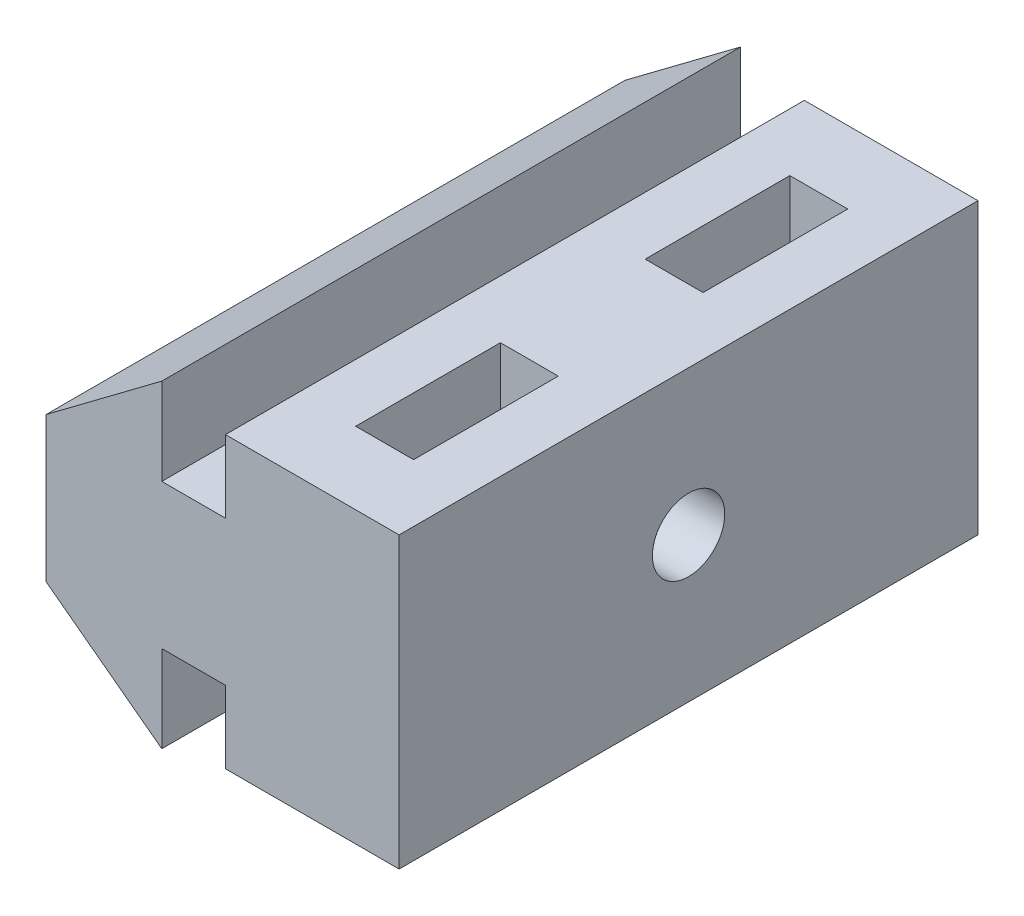
ISO-10303-21;
HEADER;
FILE_DESCRIPTION(('STEP AP214'),'2;1');
FILE_NAME('part.step','',(''),(''),'','','');
FILE_SCHEMA(('AUTOMOTIVE_DESIGN { 1 0 10303 214 1 1 1 1 }'));
ENDSEC;
DATA;
#1=APPLICATION_CONTEXT('core data for automotive mechanical design processes');
#2=APPLICATION_PROTOCOL_DEFINITION('international standard','automotive_design',2000,#1);
#3=PRODUCT_CONTEXT('',#1,'mechanical');
#4=PRODUCT('Part','Part','',(#3));
#5=PRODUCT_RELATED_PRODUCT_CATEGORY('part','',(#4));
#6=PRODUCT_DEFINITION_FORMATION('','',#4);
#7=PRODUCT_DEFINITION_CONTEXT('part definition',#1,'design');
#8=PRODUCT_DEFINITION('design','',#6,#7);
#9=PRODUCT_DEFINITION_SHAPE('','',#8);
#10=(LENGTH_UNIT() NAMED_UNIT(*) SI_UNIT(.MILLI.,.METRE.));
#11=(NAMED_UNIT(*) PLANE_ANGLE_UNIT() SI_UNIT($,.RADIAN.));
#12=(NAMED_UNIT(*) SI_UNIT($,.STERADIAN.) SOLID_ANGLE_UNIT());
#13=UNCERTAINTY_MEASURE_WITH_UNIT(LENGTH_MEASURE(1.E-05),#10,'distance_accuracy_value','');
#14=(GEOMETRIC_REPRESENTATION_CONTEXT(3) GLOBAL_UNCERTAINTY_ASSIGNED_CONTEXT((#13)) GLOBAL_UNIT_ASSIGNED_CONTEXT((#10,
#11,#12)) REPRESENTATION_CONTEXT('',''));
#15=CARTESIAN_POINT('',(0.,0.,0.));
#16=DIRECTION('',(0.,0.,1.));
#17=DIRECTION('',(1.,0.,0.));
#18=AXIS2_PLACEMENT_3D('',#15,#16,#17);
#19=CARTESIAN_POINT('',(0.,0.,20.));
#20=DIRECTION('',(0.6,0.8,0.));
#21=DIRECTION('',(-0.8,0.6,0.));
#22=AXIS2_PLACEMENT_3D('',#19,#20,#21);
#23=PLANE('',#22);
#24=DIRECTION('',(0.8,-0.6,0.));
#25=VECTOR('',#24,1.);
#26=CARTESIAN_POINT('',(0.,0.,0.));
#27=LINE('',#26,#25);
#28=CARTESIAN_POINT('',(0.,0.,0.));
#29=VERTEX_POINT('',#28);
#30=CARTESIAN_POINT('',(4.,-3.,0.));
#31=VERTEX_POINT('',#30);
#32=EDGE_CURVE('E241',#29,#31,#27,.T.);
#33=ORIENTED_EDGE('',*,*,#32,.T.);
#34=DIRECTION('',(0.,0.,-1.));
#35=VECTOR('',#34,1.);
#36=CARTESIAN_POINT('',(4.,-3.,20.));
#37=LINE('',#36,#35);
#38=CARTESIAN_POINT('',(4.,-3.,20.));
#39=VERTEX_POINT('',#38);
#40=EDGE_CURVE('E11',#39,#31,#37,.T.);
#41=ORIENTED_EDGE('',*,*,#40,.F.);
#42=DIRECTION('',(0.8,-0.6,0.));
#43=VECTOR('',#42,1.);
#44=CARTESIAN_POINT('',(0.,0.,20.));
#45=LINE('',#44,#43);
#46=CARTESIAN_POINT('',(0.,0.,20.));
#47=VERTEX_POINT('',#46);
#48=EDGE_CURVE('E244',#47,#39,#45,.T.);
#49=ORIENTED_EDGE('',*,*,#48,.F.);
#50=DIRECTION('',(0.,0.,-1.));
#51=VECTOR('',#50,1.);
#52=CARTESIAN_POINT('',(0.,0.,20.));
#53=LINE('',#52,#51);
#54=EDGE_CURVE('E270',#47,#29,#53,.T.);
#55=ORIENTED_EDGE('',*,*,#54,.T.);
#56=EDGE_LOOP('',(#33,#41,#49,#55));
#57=FACE_BOUND('',#56,.T.);
#58=ADVANCED_FACE('F32',(#57),#23,.F.);
#59=CARTESIAN_POINT('',(4.,0.,20.));
#60=DIRECTION('',(-1.,0.,0.));
#61=DIRECTION('',(0.,0.,1.));
#62=AXIS2_PLACEMENT_3D('',#59,#60,#61);
#63=PLANE('',#62);
#64=DIRECTION('',(0.,1.,0.));
#65=VECTOR('',#64,1.);
#66=CARTESIAN_POINT('',(4.,0.,0.));
#67=LINE('',#66,#65);
#68=CARTESIAN_POINT('',(4.,0.,0.));
#69=VERTEX_POINT('',#68);
#70=EDGE_CURVE('E273',#31,#69,#67,.T.);
#71=ORIENTED_EDGE('',*,*,#70,.T.);
#72=DIRECTION('',(0.,0.,-1.));
#73=VECTOR('',#72,1.);
#74=CARTESIAN_POINT('',(4.,0.,20.));
#75=LINE('',#74,#73);
#76=CARTESIAN_POINT('',(4.,0.,20.));
#77=VERTEX_POINT('',#76);
#78=EDGE_CURVE('E39',#77,#69,#75,.T.);
#79=ORIENTED_EDGE('',*,*,#78,.F.);
#80=DIRECTION('',(0.,1.,0.));
#81=VECTOR('',#80,1.);
#82=CARTESIAN_POINT('',(4.,0.,20.));
#83=LINE('',#82,#81);
#84=EDGE_CURVE('E247',#39,#77,#83,.T.);
#85=ORIENTED_EDGE('',*,*,#84,.F.);
#86=ORIENTED_EDGE('',*,*,#40,.T.);
#87=EDGE_LOOP('',(#71,#79,#85,#86));
#88=FACE_BOUND('',#87,.T.);
#89=ADVANCED_FACE('F350',(#88),#63,.F.);
#90=CARTESIAN_POINT('',(6.2,0.,20.));
#91=DIRECTION('',(0.,1.,0.));
#92=DIRECTION('',(-1.,0.,0.));
#93=AXIS2_PLACEMENT_3D('',#90,#91,#92);
#94=PLANE('',#93);
#95=DIRECTION('',(1.,0.,0.));
#96=VECTOR('',#95,1.);
#97=CARTESIAN_POINT('',(6.2,0.,0.));
#98=LINE('',#97,#96);
#99=CARTESIAN_POINT('',(6.2,0.,0.));
#100=VERTEX_POINT('',#99);
#101=EDGE_CURVE('E275',#69,#100,#98,.T.);
#102=ORIENTED_EDGE('',*,*,#101,.T.);
#103=DIRECTION('',(0.,0.,-1.));
#104=VECTOR('',#103,1.);
#105=CARTESIAN_POINT('',(6.2,0.,20.));
#106=LINE('',#105,#104);
#107=CARTESIAN_POINT('',(6.2,0.,20.));
#108=VERTEX_POINT('',#107);
#109=EDGE_CURVE('E320',#108,#100,#106,.T.);
#110=ORIENTED_EDGE('',*,*,#109,.F.);
#111=DIRECTION('',(1.,0.,0.));
#112=VECTOR('',#111,1.);
#113=CARTESIAN_POINT('',(6.2,0.,20.));
#114=LINE('',#113,#112);
#115=EDGE_CURVE('E250',#77,#108,#114,.T.);
#116=ORIENTED_EDGE('',*,*,#115,.F.);
#117=ORIENTED_EDGE('',*,*,#78,.T.);
#118=EDGE_LOOP('',(#102,#110,#116,#117));
#119=FACE_BOUND('',#118,.T.);
#120=ADVANCED_FACE('F327',(#119),#94,.F.);
#121=CARTESIAN_POINT('',(6.2,0.,20.));
#122=DIRECTION('',(1.,0.,0.));
#123=DIRECTION('',(0.,0.,-1.));
#124=AXIS2_PLACEMENT_3D('',#121,#122,#123);
#125=PLANE('',#124);
#126=DIRECTION('',(0.,-1.,0.));
#127=VECTOR('',#126,1.);
#128=CARTESIAN_POINT('',(6.2,0.,0.));
#129=LINE('',#128,#127);
#130=CARTESIAN_POINT('',(6.2,-2.5,0.));
#131=VERTEX_POINT('',#130);
#132=EDGE_CURVE('E277',#100,#131,#129,.T.);
#133=ORIENTED_EDGE('',*,*,#132,.T.);
#134=DIRECTION('',(0.,0.,-1.));
#135=VECTOR('',#134,1.);
#136=CARTESIAN_POINT('',(6.2,-2.5,20.));
#137=LINE('',#136,#135);
#138=CARTESIAN_POINT('',(6.2,-2.5,20.));
#139=VERTEX_POINT('',#138);
#140=EDGE_CURVE('E317',#139,#131,#137,.T.);
#141=ORIENTED_EDGE('',*,*,#140,.F.);
#142=DIRECTION('',(0.,-1.,0.));
#143=VECTOR('',#142,1.);
#144=CARTESIAN_POINT('',(6.2,0.,20.));
#145=LINE('',#144,#143);
#146=EDGE_CURVE('E252',#108,#139,#145,.T.);
#147=ORIENTED_EDGE('',*,*,#146,.F.);
#148=ORIENTED_EDGE('',*,*,#109,.T.);
#149=EDGE_LOOP('',(#133,#141,#147,#148));
#150=FACE_BOUND('',#149,.T.);
#151=ADVANCED_FACE('F338',(#150),#125,.F.);
#152=CARTESIAN_POINT('',(6.2,-2.5,20.));
#153=DIRECTION('',(0.,1.,0.));
#154=DIRECTION('',(0.,0.,1.));
#155=AXIS2_PLACEMENT_3D('',#152,#153,#154);
#156=PLANE('',#155);
#157=DIRECTION('',(-1.,0.,0.));
#158=VECTOR('',#157,1.);
#159=CARTESIAN_POINT('',(6.2,-2.5,2.5));
#160=LINE('',#159,#158);
#161=CARTESIAN_POINT('',(10.2,-2.5,2.5));
#162=VERTEX_POINT('',#161);
#163=CARTESIAN_POINT('',(8.2,-2.5,2.5));
#164=VERTEX_POINT('',#163);
#165=EDGE_CURVE('E199',#162,#164,#160,.T.);
#166=ORIENTED_EDGE('',*,*,#165,.T.);
#167=DIRECTION('',(0.,0.,1.));
#168=VECTOR('',#167,1.);
#169=CARTESIAN_POINT('',(8.2,-2.5,20.));
#170=LINE('',#169,#168);
#171=CARTESIAN_POINT('',(8.2,-2.5,7.5));
#172=VERTEX_POINT('',#171);
#173=EDGE_CURVE('E202',#164,#172,#170,.T.);
#174=ORIENTED_EDGE('',*,*,#173,.T.);
#175=DIRECTION('',(1.,0.,0.));
#176=VECTOR('',#175,1.);
#177=CARTESIAN_POINT('',(6.2,-2.5,7.5));
#178=LINE('',#177,#176);
#179=CARTESIAN_POINT('',(10.2,-2.5,7.5));
#180=VERTEX_POINT('',#179);
#181=EDGE_CURVE('E194',#172,#180,#178,.T.);
#182=ORIENTED_EDGE('',*,*,#181,.T.);
#183=DIRECTION('',(0.,0.,-1.));
#184=VECTOR('',#183,1.);
#185=CARTESIAN_POINT('',(10.2,-2.5,20.));
#186=LINE('',#185,#184);
#187=EDGE_CURVE('E174',#180,#162,#186,.T.);
#188=ORIENTED_EDGE('',*,*,#187,.T.);
#189=EDGE_LOOP('',(#166,#174,#182,#188));
#190=FACE_BOUND('',#189,.T.);
#191=DIRECTION('',(-1.,0.,0.));
#192=VECTOR('',#191,1.);
#193=CARTESIAN_POINT('',(6.19999999999999,-2.5,12.5));
#194=LINE('',#193,#192);
#195=CARTESIAN_POINT('',(10.2,-2.5,12.5));
#196=VERTEX_POINT('',#195);
#197=CARTESIAN_POINT('',(8.2,-2.5,12.5));
#198=VERTEX_POINT('',#197);
#199=EDGE_CURVE('E231',#196,#198,#194,.T.);
#200=ORIENTED_EDGE('',*,*,#199,.T.);
#201=DIRECTION('',(0.,0.,1.));
#202=VECTOR('',#201,1.);
#203=CARTESIAN_POINT('',(8.2,-2.5,20.));
#204=LINE('',#203,#202);
#205=CARTESIAN_POINT('',(8.2,-2.5,17.5));
#206=VERTEX_POINT('',#205);
#207=EDGE_CURVE('E234',#198,#206,#204,.T.);
#208=ORIENTED_EDGE('',*,*,#207,.T.);
#209=DIRECTION('',(1.,0.,0.));
#210=VECTOR('',#209,1.);
#211=CARTESIAN_POINT('',(6.2,-2.5,17.5));
#212=LINE('',#211,#210);
#213=CARTESIAN_POINT('',(10.2,-2.5,17.5));
#214=VERTEX_POINT('',#213);
#215=EDGE_CURVE('E219',#206,#214,#212,.T.);
#216=ORIENTED_EDGE('',*,*,#215,.T.);
#217=DIRECTION('',(0.,0.,-1.));
#218=VECTOR('',#217,1.);
#219=CARTESIAN_POINT('',(10.2,-2.5,20.));
#220=LINE('',#219,#218);
#221=EDGE_CURVE('E228',#214,#196,#220,.T.);
#222=ORIENTED_EDGE('',*,*,#221,.T.);
#223=EDGE_LOOP('',(#200,#208,#216,#222));
#224=FACE_BOUND('',#223,.T.);
#225=DIRECTION('',(1.,0.,0.));
#226=VECTOR('',#225,1.);
#227=CARTESIAN_POINT('',(6.2,-2.5,0.));
#228=LINE('',#227,#226);
#229=CARTESIAN_POINT('',(12.2,-2.5,0.));
#230=VERTEX_POINT('',#229);
#231=EDGE_CURVE('E279',#131,#230,#228,.T.);
#232=ORIENTED_EDGE('',*,*,#231,.T.);
#233=DIRECTION('',(0.,0.,-1.));
#234=VECTOR('',#233,1.);
#235=CARTESIAN_POINT('',(12.2,-2.5,20.));
#236=LINE('',#235,#234);
#237=CARTESIAN_POINT('',(12.2,-2.5,20.));
#238=VERTEX_POINT('',#237);
#239=EDGE_CURVE('E314',#238,#230,#236,.T.);
#240=ORIENTED_EDGE('',*,*,#239,.F.);
#241=DIRECTION('',(1.,0.,0.));
#242=VECTOR('',#241,1.);
#243=CARTESIAN_POINT('',(6.2,-2.5,20.));
#244=LINE('',#243,#242);
#245=EDGE_CURVE('E254',#139,#238,#244,.T.);
#246=ORIENTED_EDGE('',*,*,#245,.F.);
#247=ORIENTED_EDGE('',*,*,#140,.T.);
#248=EDGE_LOOP('',(#232,#240,#246,#247));
#249=FACE_BOUND('',#248,.T.);
#250=ADVANCED_FACE('F342',(#190,#224,#249),#156,.F.);
#251=CARTESIAN_POINT('',(12.2,-2.5,20.));
#252=DIRECTION('',(-1.,0.,0.));
#253=DIRECTION('',(0.,0.,1.));
#254=AXIS2_PLACEMENT_3D('',#251,#252,#253);
#255=PLANE('',#254);
#256=CARTESIAN_POINT('',(12.2,2.5,10.));
#257=DIRECTION('',(1.,0.,0.));
#258=DIRECTION('',(0.,0.,-1.));
#259=AXIS2_PLACEMENT_3D('',#256,#257,#258);
#260=CIRCLE('',#259,1.25);
#261=CARTESIAN_POINT('',(12.2,2.5,8.75));
#262=VERTEX_POINT('',#261);
#263=EDGE_CURVE('E237',#262,#262,#260,.T.);
#264=ORIENTED_EDGE('',*,*,#263,.F.);
#265=EDGE_LOOP('',(#264));
#266=FACE_BOUND('',#265,.T.);
#267=DIRECTION('',(0.,1.,0.));
#268=VECTOR('',#267,1.);
#269=CARTESIAN_POINT('',(12.2,-2.5,0.));
#270=LINE('',#269,#268);
#271=CARTESIAN_POINT('',(12.2,7.5,0.));
#272=VERTEX_POINT('',#271);
#273=EDGE_CURVE('E281',#230,#272,#270,.T.);
#274=ORIENTED_EDGE('',*,*,#273,.T.);
#275=DIRECTION('',(0.,0.,-1.));
#276=VECTOR('',#275,1.);
#277=CARTESIAN_POINT('',(12.2,7.5,20.));
#278=LINE('',#277,#276);
#279=CARTESIAN_POINT('',(12.2,7.5,20.));
#280=VERTEX_POINT('',#279);
#281=EDGE_CURVE('E311',#280,#272,#278,.T.);
#282=ORIENTED_EDGE('',*,*,#281,.F.);
#283=DIRECTION('',(0.,1.,0.));
#284=VECTOR('',#283,1.);
#285=CARTESIAN_POINT('',(12.2,-2.5,20.));
#286=LINE('',#285,#284);
#287=EDGE_CURVE('E256',#238,#280,#286,.T.);
#288=ORIENTED_EDGE('',*,*,#287,.F.);
#289=ORIENTED_EDGE('',*,*,#239,.T.);
#290=EDGE_LOOP('',(#274,#282,#288,#289));
#291=FACE_BOUND('',#290,.T.);
#292=ADVANCED_FACE('F382',(#266,#291),#255,.F.);
#293=CARTESIAN_POINT('',(6.2,7.5,20.));
#294=DIRECTION('',(0.,-1.,0.));
#295=DIRECTION('',(0.,0.,-1.));
#296=AXIS2_PLACEMENT_3D('',#293,#294,#295);
#297=PLANE('',#296);
#298=DIRECTION('',(1.,0.,0.));
#299=VECTOR('',#298,1.);
#300=CARTESIAN_POINT('',(8.2,7.5,7.5));
#301=LINE('',#300,#299);
#302=CARTESIAN_POINT('',(8.2,7.5,7.5));
#303=VERTEX_POINT('',#302);
#304=CARTESIAN_POINT('',(10.2,7.5,7.5));
#305=VERTEX_POINT('',#304);
#306=EDGE_CURVE('E180',#303,#305,#301,.T.);
#307=ORIENTED_EDGE('',*,*,#306,.F.);
#308=DIRECTION('',(0.,0.,1.));
#309=VECTOR('',#308,1.);
#310=CARTESIAN_POINT('',(8.2,7.5,2.5));
#311=LINE('',#310,#309);
#312=CARTESIAN_POINT('',(8.2,7.5,2.5));
#313=VERTEX_POINT('',#312);
#314=EDGE_CURVE('E54',#313,#303,#311,.T.);
#315=ORIENTED_EDGE('',*,*,#314,.F.);
#316=DIRECTION('',(-1.,0.,0.));
#317=VECTOR('',#316,1.);
#318=CARTESIAN_POINT('',(8.2,7.5,2.5));
#319=LINE('',#318,#317);
#320=CARTESIAN_POINT('',(10.2,7.5,2.5));
#321=VERTEX_POINT('',#320);
#322=EDGE_CURVE('E187',#321,#313,#319,.T.);
#323=ORIENTED_EDGE('',*,*,#322,.F.);
#324=DIRECTION('',(0.,0.,-1.));
#325=VECTOR('',#324,1.);
#326=CARTESIAN_POINT('',(10.2,7.5,2.5));
#327=LINE('',#326,#325);
#328=EDGE_CURVE('E171',#305,#321,#327,.T.);
#329=ORIENTED_EDGE('',*,*,#328,.F.);
#330=EDGE_LOOP('',(#307,#315,#323,#329));
#331=FACE_BOUND('',#330,.T.);
#332=DIRECTION('',(1.,0.,0.));
#333=VECTOR('',#332,1.);
#334=CARTESIAN_POINT('',(8.2,7.5,17.5));
#335=LINE('',#334,#333);
#336=CARTESIAN_POINT('',(8.2,7.5,17.5));
#337=VERTEX_POINT('',#336);
#338=CARTESIAN_POINT('',(10.2,7.5,17.5));
#339=VERTEX_POINT('',#338);
#340=EDGE_CURVE('E207',#337,#339,#335,.T.);
#341=ORIENTED_EDGE('',*,*,#340,.F.);
#342=DIRECTION('',(0.,0.,1.));
#343=VECTOR('',#342,1.);
#344=CARTESIAN_POINT('',(8.2,7.5,12.5));
#345=LINE('',#344,#343);
#346=CARTESIAN_POINT('',(8.2,7.5,12.5));
#347=VERTEX_POINT('',#346);
#348=EDGE_CURVE('E205',#347,#337,#345,.T.);
#349=ORIENTED_EDGE('',*,*,#348,.F.);
#350=DIRECTION('',(-1.,0.,0.));
#351=VECTOR('',#350,1.);
#352=CARTESIAN_POINT('',(8.2,7.5,12.5));
#353=LINE('',#352,#351);
#354=CARTESIAN_POINT('',(10.2,7.5,12.5));
#355=VERTEX_POINT('',#354);
#356=EDGE_CURVE('E213',#355,#347,#353,.T.);
#357=ORIENTED_EDGE('',*,*,#356,.F.);
#358=DIRECTION('',(0.,0.,-1.));
#359=VECTOR('',#358,1.);
#360=CARTESIAN_POINT('',(10.2,7.5,12.5));
#361=LINE('',#360,#359);
#362=EDGE_CURVE('E210',#339,#355,#361,.T.);
#363=ORIENTED_EDGE('',*,*,#362,.F.);
#364=EDGE_LOOP('',(#341,#349,#357,#363));
#365=FACE_BOUND('',#364,.T.);
#366=DIRECTION('',(-1.,0.,0.));
#367=VECTOR('',#366,1.);
#368=CARTESIAN_POINT('',(6.2,7.5,0.));
#369=LINE('',#368,#367);
#370=CARTESIAN_POINT('',(6.2,7.5,0.));
#371=VERTEX_POINT('',#370);
#372=EDGE_CURVE('E283',#272,#371,#369,.T.);
#373=ORIENTED_EDGE('',*,*,#372,.T.);
#374=DIRECTION('',(0.,0.,-1.));
#375=VECTOR('',#374,1.);
#376=CARTESIAN_POINT('',(6.2,7.5,20.));
#377=LINE('',#376,#375);
#378=CARTESIAN_POINT('',(6.2,7.5,20.));
#379=VERTEX_POINT('',#378);
#380=EDGE_CURVE('E308',#379,#371,#377,.T.);
#381=ORIENTED_EDGE('',*,*,#380,.F.);
#382=DIRECTION('',(-1.,0.,0.));
#383=VECTOR('',#382,1.);
#384=CARTESIAN_POINT('',(6.2,7.5,20.));
#385=LINE('',#384,#383);
#386=EDGE_CURVE('E258',#280,#379,#385,.T.);
#387=ORIENTED_EDGE('',*,*,#386,.F.);
#388=ORIENTED_EDGE('',*,*,#281,.T.);
#389=EDGE_LOOP('',(#373,#381,#387,#388));
#390=FACE_BOUND('',#389,.T.);
#391=ADVANCED_FACE('F184',(#331,#365,#390),#297,.F.);
#392=CARTESIAN_POINT('',(6.2,5.,20.));
#393=DIRECTION('',(1.,0.,0.));
#394=DIRECTION('',(0.,0.,-1.));
#395=AXIS2_PLACEMENT_3D('',#392,#393,#394);
#396=PLANE('',#395);
#397=DIRECTION('',(0.,-1.,0.));
#398=VECTOR('',#397,1.);
#399=CARTESIAN_POINT('',(6.2,5.,0.));
#400=LINE('',#399,#398);
#401=CARTESIAN_POINT('',(6.2,5.,0.));
#402=VERTEX_POINT('',#401);
#403=EDGE_CURVE('E285',#371,#402,#400,.T.);
#404=ORIENTED_EDGE('',*,*,#403,.T.);
#405=DIRECTION('',(0.,0.,-1.));
#406=VECTOR('',#405,1.);
#407=CARTESIAN_POINT('',(6.2,5.,20.));
#408=LINE('',#407,#406);
#409=CARTESIAN_POINT('',(6.2,5.,20.));
#410=VERTEX_POINT('',#409);
#411=EDGE_CURVE('E305',#410,#402,#408,.T.);
#412=ORIENTED_EDGE('',*,*,#411,.F.);
#413=DIRECTION('',(0.,-1.,0.));
#414=VECTOR('',#413,1.);
#415=CARTESIAN_POINT('',(6.2,5.,20.));
#416=LINE('',#415,#414);
#417=EDGE_CURVE('E260',#379,#410,#416,.T.);
#418=ORIENTED_EDGE('',*,*,#417,.F.);
#419=ORIENTED_EDGE('',*,*,#380,.T.);
#420=EDGE_LOOP('',(#404,#412,#418,#419));
#421=FACE_BOUND('',#420,.T.);
#422=ADVANCED_FACE('F377',(#421),#396,.F.);
#423=CARTESIAN_POINT('',(4.,5.,20.));
#424=DIRECTION('',(0.,-1.,0.));
#425=DIRECTION('',(0.,0.,-1.));
#426=AXIS2_PLACEMENT_3D('',#423,#424,#425);
#427=PLANE('',#426);
#428=DIRECTION('',(-1.,0.,0.));
#429=VECTOR('',#428,1.);
#430=CARTESIAN_POINT('',(4.,5.,0.));
#431=LINE('',#430,#429);
#432=CARTESIAN_POINT('',(4.,5.,0.));
#433=VERTEX_POINT('',#432);
#434=EDGE_CURVE('E287',#402,#433,#431,.T.);
#435=ORIENTED_EDGE('',*,*,#434,.T.);
#436=DIRECTION('',(0.,0.,-1.));
#437=VECTOR('',#436,1.);
#438=CARTESIAN_POINT('',(4.,5.,20.));
#439=LINE('',#438,#437);
#440=CARTESIAN_POINT('',(4.,5.,20.));
#441=VERTEX_POINT('',#440);
#442=EDGE_CURVE('E302',#441,#433,#439,.T.);
#443=ORIENTED_EDGE('',*,*,#442,.F.);
#444=DIRECTION('',(-1.,0.,0.));
#445=VECTOR('',#444,1.);
#446=CARTESIAN_POINT('',(4.,5.,20.));
#447=LINE('',#446,#445);
#448=EDGE_CURVE('E262',#410,#441,#447,.T.);
#449=ORIENTED_EDGE('',*,*,#448,.F.);
#450=ORIENTED_EDGE('',*,*,#411,.T.);
#451=EDGE_LOOP('',(#435,#443,#449,#450));
#452=FACE_BOUND('',#451,.T.);
#453=ADVANCED_FACE('F372',(#452),#427,.F.);
#454=CARTESIAN_POINT('',(4.,8.,20.));
#455=DIRECTION('',(-1.,0.,0.));
#456=DIRECTION('',(0.,0.,1.));
#457=AXIS2_PLACEMENT_3D('',#454,#455,#456);
#458=PLANE('',#457);
#459=DIRECTION('',(0.,1.,0.));
#460=VECTOR('',#459,1.);
#461=CARTESIAN_POINT('',(4.,8.,0.));
#462=LINE('',#461,#460);
#463=CARTESIAN_POINT('',(4.,8.,0.));
#464=VERTEX_POINT('',#463);
#465=EDGE_CURVE('E289',#433,#464,#462,.T.);
#466=ORIENTED_EDGE('',*,*,#465,.T.);
#467=DIRECTION('',(0.,0.,-1.));
#468=VECTOR('',#467,1.);
#469=CARTESIAN_POINT('',(4.,8.,20.));
#470=LINE('',#469,#468);
#471=CARTESIAN_POINT('',(4.,8.,20.));
#472=VERTEX_POINT('',#471);
#473=EDGE_CURVE('E299',#472,#464,#470,.T.);
#474=ORIENTED_EDGE('',*,*,#473,.F.);
#475=DIRECTION('',(0.,1.,0.));
#476=VECTOR('',#475,1.);
#477=CARTESIAN_POINT('',(4.,8.,20.));
#478=LINE('',#477,#476);
#479=EDGE_CURVE('E264',#441,#472,#478,.T.);
#480=ORIENTED_EDGE('',*,*,#479,.F.);
#481=ORIENTED_EDGE('',*,*,#442,.T.);
#482=EDGE_LOOP('',(#466,#474,#480,#481));
#483=FACE_BOUND('',#482,.T.);
#484=ADVANCED_FACE('F366',(#483),#458,.F.);
#485=CARTESIAN_POINT('',(0.,5.,20.));
#486=DIRECTION('',(0.6,-0.8,0.));
#487=DIRECTION('',(0.8,0.6,0.));
#488=AXIS2_PLACEMENT_3D('',#485,#486,#487);
#489=PLANE('',#488);
#490=DIRECTION('',(-0.8,-0.6,0.));
#491=VECTOR('',#490,1.);
#492=CARTESIAN_POINT('',(0.,5.,0.));
#493=LINE('',#492,#491);
#494=CARTESIAN_POINT('',(0.,5.,0.));
#495=VERTEX_POINT('',#494);
#496=EDGE_CURVE('E291',#464,#495,#493,.T.);
#497=ORIENTED_EDGE('',*,*,#496,.T.);
#498=DIRECTION('',(0.,0.,-1.));
#499=VECTOR('',#498,1.);
#500=CARTESIAN_POINT('',(0.,5.,20.));
#501=LINE('',#500,#499);
#502=CARTESIAN_POINT('',(0.,5.,20.));
#503=VERTEX_POINT('',#502);
#504=EDGE_CURVE('E296',#503,#495,#501,.T.);
#505=ORIENTED_EDGE('',*,*,#504,.F.);
#506=DIRECTION('',(-0.8,-0.6,0.));
#507=VECTOR('',#506,1.);
#508=CARTESIAN_POINT('',(0.,5.,20.));
#509=LINE('',#508,#507);
#510=EDGE_CURVE('E266',#472,#503,#509,.T.);
#511=ORIENTED_EDGE('',*,*,#510,.F.);
#512=ORIENTED_EDGE('',*,*,#473,.T.);
#513=EDGE_LOOP('',(#497,#505,#511,#512));
#514=FACE_BOUND('',#513,.T.);
#515=ADVANCED_FACE('F362',(#514),#489,.F.);
#516=CARTESIAN_POINT('',(0.,0.,20.));
#517=DIRECTION('',(1.,0.,0.));
#518=DIRECTION('',(0.,0.,-1.));
#519=AXIS2_PLACEMENT_3D('',#516,#517,#518);
#520=PLANE('',#519);
#521=CARTESIAN_POINT('',(0.,2.5,10.));
#522=DIRECTION('',(1.,0.,0.));
#523=DIRECTION('',(0.,0.,-1.));
#524=AXIS2_PLACEMENT_3D('',#521,#522,#523);
#525=CIRCLE('',#524,1.25);
#526=CARTESIAN_POINT('',(0.,2.5,8.75));
#527=VERTEX_POINT('',#526);
#528=EDGE_CURVE('E238',#527,#527,#525,.T.);
#529=ORIENTED_EDGE('',*,*,#528,.T.);
#530=EDGE_LOOP('',(#529));
#531=FACE_BOUND('',#530,.T.);
#532=DIRECTION('',(0.,-1.,0.));
#533=VECTOR('',#532,1.);
#534=CARTESIAN_POINT('',(0.,0.,0.));
#535=LINE('',#534,#533);
#536=EDGE_CURVE('E248',#495,#29,#535,.T.);
#537=ORIENTED_EDGE('',*,*,#536,.T.);
#538=ORIENTED_EDGE('',*,*,#54,.F.);
#539=DIRECTION('',(0.,-1.,0.));
#540=VECTOR('',#539,1.);
#541=CARTESIAN_POINT('',(0.,0.,20.));
#542=LINE('',#541,#540);
#543=EDGE_CURVE('E268',#503,#47,#542,.T.);
#544=ORIENTED_EDGE('',*,*,#543,.F.);
#545=ORIENTED_EDGE('',*,*,#504,.T.);
#546=EDGE_LOOP('',(#537,#538,#544,#545));
#547=FACE_BOUND('',#546,.T.);
#548=ADVANCED_FACE('F357',(#531,#547),#520,.F.);
#549=CARTESIAN_POINT('',(0.,0.,20.));
#550=DIRECTION('',(0.,0.,1.));
#551=DIRECTION('',(1.,0.,0.));
#552=AXIS2_PLACEMENT_3D('',#549,#550,#551);
#553=PLANE('',#552);
#554=ORIENTED_EDGE('',*,*,#48,.T.);
#555=ORIENTED_EDGE('',*,*,#84,.T.);
#556=ORIENTED_EDGE('',*,*,#115,.T.);
#557=ORIENTED_EDGE('',*,*,#146,.T.);
#558=ORIENTED_EDGE('',*,*,#245,.T.);
#559=ORIENTED_EDGE('',*,*,#287,.T.);
#560=ORIENTED_EDGE('',*,*,#386,.T.);
#561=ORIENTED_EDGE('',*,*,#417,.T.);
#562=ORIENTED_EDGE('',*,*,#448,.T.);
#563=ORIENTED_EDGE('',*,*,#479,.T.);
#564=ORIENTED_EDGE('',*,*,#510,.T.);
#565=ORIENTED_EDGE('',*,*,#543,.T.);
#566=EDGE_LOOP('',(#554,#555,#556,#557,#558,#559,#560,#561,#562,#563,#564,#565));
#567=FACE_BOUND('',#566,.T.);
#568=ADVANCED_FACE('F346',(#567),#553,.T.);
#569=CARTESIAN_POINT('',(0.,0.,0.));
#570=DIRECTION('',(0.,0.,1.));
#571=DIRECTION('',(1.,0.,0.));
#572=AXIS2_PLACEMENT_3D('',#569,#570,#571);
#573=PLANE('',#572);
#574=ORIENTED_EDGE('',*,*,#32,.F.);
#575=ORIENTED_EDGE('',*,*,#536,.F.);
#576=ORIENTED_EDGE('',*,*,#496,.F.);
#577=ORIENTED_EDGE('',*,*,#465,.F.);
#578=ORIENTED_EDGE('',*,*,#434,.F.);
#579=ORIENTED_EDGE('',*,*,#403,.F.);
#580=ORIENTED_EDGE('',*,*,#372,.F.);
#581=ORIENTED_EDGE('',*,*,#273,.F.);
#582=ORIENTED_EDGE('',*,*,#231,.F.);
#583=ORIENTED_EDGE('',*,*,#132,.F.);
#584=ORIENTED_EDGE('',*,*,#101,.F.);
#585=ORIENTED_EDGE('',*,*,#70,.F.);
#586=EDGE_LOOP('',(#574,#575,#576,#577,#578,#579,#580,#581,#582,#583,#584,#585));
#587=FACE_BOUND('',#586,.T.);
#588=ADVANCED_FACE('F333',(#587),#573,.F.);
#589=CARTESIAN_POINT('',(0.,2.5,10.));
#590=DIRECTION('',(1.,0.,0.));
#591=DIRECTION('',(0.,0.,-1.));
#592=AXIS2_PLACEMENT_3D('',#589,#590,#591);
#593=CYLINDRICAL_SURFACE('',#592,1.25);
#594=ORIENTED_EDGE('',*,*,#528,.F.);
#595=EDGE_LOOP('',(#594));
#596=FACE_BOUND('',#595,.T.);
#597=ORIENTED_EDGE('',*,*,#263,.T.);
#598=EDGE_LOOP('',(#597));
#599=FACE_BOUND('',#598,.T.);
#600=ADVANCED_FACE('F420',(#596,#599),#593,.F.);
#601=CARTESIAN_POINT('',(8.2,-3.,12.5));
#602=DIRECTION('',(-1.,0.,0.));
#603=DIRECTION('',(0.,0.,1.));
#604=AXIS2_PLACEMENT_3D('',#601,#602,#603);
#605=PLANE('',#604);
#606=DIRECTION('',(0.,1.,0.));
#607=VECTOR('',#606,1.);
#608=CARTESIAN_POINT('',(8.2,-3.,12.5));
#609=LINE('',#608,#607);
#610=EDGE_CURVE('E217',#198,#347,#609,.T.);
#611=ORIENTED_EDGE('',*,*,#610,.T.);
#612=ORIENTED_EDGE('',*,*,#348,.T.);
#613=DIRECTION('',(0.,1.,0.));
#614=VECTOR('',#613,1.);
#615=CARTESIAN_POINT('',(8.2,-3.,17.5));
#616=LINE('',#615,#614);
#617=EDGE_CURVE('E216',#206,#337,#616,.T.);
#618=ORIENTED_EDGE('',*,*,#617,.F.);
#619=ORIENTED_EDGE('',*,*,#207,.F.);
#620=EDGE_LOOP('',(#611,#612,#618,#619));
#621=FACE_BOUND('',#620,.T.);
#622=ADVANCED_FACE('F433',(#621),#605,.F.);
#623=CARTESIAN_POINT('',(8.2,-3.,12.5));
#624=DIRECTION('',(0.,0.,-1.));
#625=DIRECTION('',(-1.,0.,0.));
#626=AXIS2_PLACEMENT_3D('',#623,#624,#625);
#627=PLANE('',#626);
#628=DIRECTION('',(0.,1.,0.));
#629=VECTOR('',#628,1.);
#630=CARTESIAN_POINT('',(10.2,-3.,12.5));
#631=LINE('',#630,#629);
#632=EDGE_CURVE('E220',#196,#355,#631,.T.);
#633=ORIENTED_EDGE('',*,*,#632,.T.);
#634=ORIENTED_EDGE('',*,*,#356,.T.);
#635=ORIENTED_EDGE('',*,*,#610,.F.);
#636=ORIENTED_EDGE('',*,*,#199,.F.);
#637=EDGE_LOOP('',(#633,#634,#635,#636));
#638=FACE_BOUND('',#637,.T.);
#639=ADVANCED_FACE('F438',(#638),#627,.F.);
#640=CARTESIAN_POINT('',(10.2,-3.,12.5));
#641=DIRECTION('',(1.,0.,0.));
#642=DIRECTION('',(0.,0.,-1.));
#643=AXIS2_PLACEMENT_3D('',#640,#641,#642);
#644=PLANE('',#643);
#645=DIRECTION('',(0.,1.,0.));
#646=VECTOR('',#645,1.);
#647=CARTESIAN_POINT('',(10.2,-3.,17.5));
#648=LINE('',#647,#646);
#649=EDGE_CURVE('E222',#214,#339,#648,.T.);
#650=ORIENTED_EDGE('',*,*,#649,.T.);
#651=ORIENTED_EDGE('',*,*,#362,.T.);
#652=ORIENTED_EDGE('',*,*,#632,.F.);
#653=ORIENTED_EDGE('',*,*,#221,.F.);
#654=EDGE_LOOP('',(#650,#651,#652,#653));
#655=FACE_BOUND('',#654,.T.);
#656=ADVANCED_FACE('F448',(#655),#644,.F.);
#657=CARTESIAN_POINT('',(8.2,-3.,17.5));
#658=DIRECTION('',(0.,0.,1.));
#659=DIRECTION('',(1.,0.,0.));
#660=AXIS2_PLACEMENT_3D('',#657,#658,#659);
#661=PLANE('',#660);
#662=ORIENTED_EDGE('',*,*,#617,.T.);
#663=ORIENTED_EDGE('',*,*,#340,.T.);
#664=ORIENTED_EDGE('',*,*,#649,.F.);
#665=ORIENTED_EDGE('',*,*,#215,.F.);
#666=EDGE_LOOP('',(#662,#663,#664,#665));
#667=FACE_BOUND('',#666,.T.);
#668=ADVANCED_FACE('F458',(#667),#661,.F.);
#669=CARTESIAN_POINT('',(8.2,-3.,2.5));
#670=DIRECTION('',(-1.,0.,0.));
#671=DIRECTION('',(0.,0.,1.));
#672=AXIS2_PLACEMENT_3D('',#669,#670,#671);
#673=PLANE('',#672);
#674=DIRECTION('',(0.,1.,0.));
#675=VECTOR('',#674,1.);
#676=CARTESIAN_POINT('',(8.2,-3.,2.5));
#677=LINE('',#676,#675);
#678=EDGE_CURVE('E192',#164,#313,#677,.T.);
#679=ORIENTED_EDGE('',*,*,#678,.T.);
#680=ORIENTED_EDGE('',*,*,#314,.T.);
#681=DIRECTION('',(0.,1.,0.));
#682=VECTOR('',#681,1.);
#683=CARTESIAN_POINT('',(8.2,-3.,7.5));
#684=LINE('',#683,#682);
#685=EDGE_CURVE('E177',#172,#303,#684,.T.);
#686=ORIENTED_EDGE('',*,*,#685,.F.);
#687=ORIENTED_EDGE('',*,*,#173,.F.);
#688=EDGE_LOOP('',(#679,#680,#686,#687));
#689=FACE_BOUND('',#688,.T.);
#690=ADVANCED_FACE('F468',(#689),#673,.F.);
#691=CARTESIAN_POINT('',(8.2,-3.,2.5));
#692=DIRECTION('',(0.,0.,-1.));
#693=DIRECTION('',(-1.,0.,0.));
#694=AXIS2_PLACEMENT_3D('',#691,#692,#693);
#695=PLANE('',#694);
#696=DIRECTION('',(0.,1.,0.));
#697=VECTOR('',#696,1.);
#698=CARTESIAN_POINT('',(10.2,-3.,2.5));
#699=LINE('',#698,#697);
#700=EDGE_CURVE('E176',#162,#321,#699,.T.);
#701=ORIENTED_EDGE('',*,*,#700,.T.);
#702=ORIENTED_EDGE('',*,*,#322,.T.);
#703=ORIENTED_EDGE('',*,*,#678,.F.);
#704=ORIENTED_EDGE('',*,*,#165,.F.);
#705=EDGE_LOOP('',(#701,#702,#703,#704));
#706=FACE_BOUND('',#705,.T.);
#707=ADVANCED_FACE('F478',(#706),#695,.F.);
#708=CARTESIAN_POINT('',(10.2,-3.,2.5));
#709=DIRECTION('',(1.,0.,0.));
#710=DIRECTION('',(0.,0.,-1.));
#711=AXIS2_PLACEMENT_3D('',#708,#709,#710);
#712=PLANE('',#711);
#713=DIRECTION('',(0.,1.,0.));
#714=VECTOR('',#713,1.);
#715=CARTESIAN_POINT('',(10.2,-3.,7.5));
#716=LINE('',#715,#714);
#717=EDGE_CURVE('E46',#180,#305,#716,.T.);
#718=ORIENTED_EDGE('',*,*,#717,.T.);
#719=ORIENTED_EDGE('',*,*,#328,.T.);
#720=ORIENTED_EDGE('',*,*,#700,.F.);
#721=ORIENTED_EDGE('',*,*,#187,.F.);
#722=EDGE_LOOP('',(#718,#719,#720,#721));
#723=FACE_BOUND('',#722,.T.);
#724=ADVANCED_FACE('F168',(#723),#712,.F.);
#725=CARTESIAN_POINT('',(8.2,-3.,7.5));
#726=DIRECTION('',(0.,0.,1.));
#727=DIRECTION('',(1.,0.,0.));
#728=AXIS2_PLACEMENT_3D('',#725,#726,#727);
#729=PLANE('',#728);
#730=ORIENTED_EDGE('',*,*,#685,.T.);
#731=ORIENTED_EDGE('',*,*,#306,.T.);
#732=ORIENTED_EDGE('',*,*,#717,.F.);
#733=ORIENTED_EDGE('',*,*,#181,.F.);
#734=EDGE_LOOP('',(#730,#731,#732,#733));
#735=FACE_BOUND('',#734,.T.);
#736=ADVANCED_FACE('F181',(#735),#729,.F.);
#737=CLOSED_SHELL('',(#58,#89,#120,#151,#250,#292,#391,#422,#453,#484,#515,#548,#568,#588,#600,
#622,#639,#656,#668,#690,#707,#724,#736));
#738=MANIFOLD_SOLID_BREP('B2',#737);
#739=ADVANCED_BREP_SHAPE_REPRESENTATION('',(#18,#738),#14);
#740=SHAPE_DEFINITION_REPRESENTATION(#9,#739);
ENDSEC;
END-ISO-10303-21;
